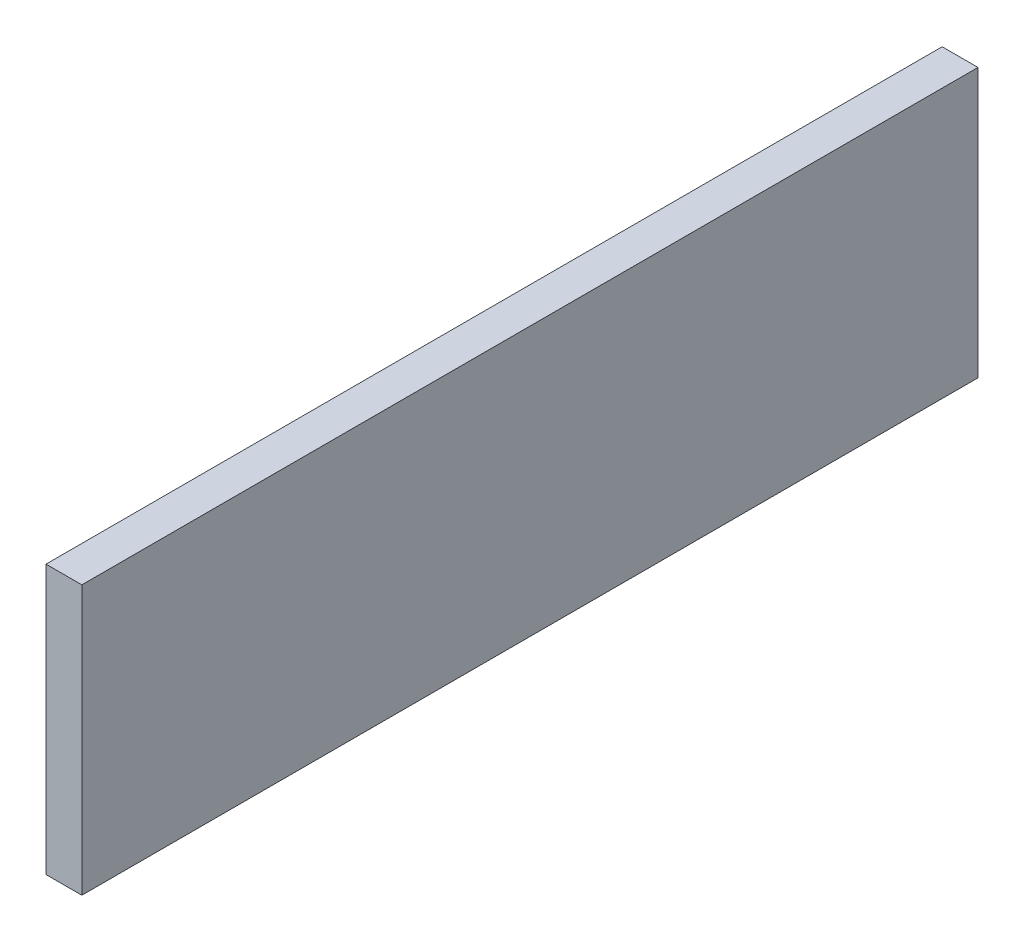
ISO-10303-21;
HEADER;
FILE_DESCRIPTION(('STEP AP214'),'2;1');
FILE_NAME('part.step','',(''),(''),'','','');
FILE_SCHEMA(('AUTOMOTIVE_DESIGN { 1 0 10303 214 1 1 1 1 }'));
ENDSEC;
DATA;
#1=APPLICATION_CONTEXT('core data for automotive mechanical design processes');
#2=APPLICATION_PROTOCOL_DEFINITION('international standard','automotive_design',2000,#1);
#3=PRODUCT_CONTEXT('',#1,'mechanical');
#4=PRODUCT('Part','Part','',(#3));
#5=PRODUCT_RELATED_PRODUCT_CATEGORY('part','',(#4));
#6=PRODUCT_DEFINITION_FORMATION('','',#4);
#7=PRODUCT_DEFINITION_CONTEXT('part definition',#1,'design');
#8=PRODUCT_DEFINITION('design','',#6,#7);
#9=PRODUCT_DEFINITION_SHAPE('','',#8);
#10=(LENGTH_UNIT() NAMED_UNIT(*) SI_UNIT(.MILLI.,.METRE.));
#11=(NAMED_UNIT(*) PLANE_ANGLE_UNIT() SI_UNIT($,.RADIAN.));
#12=(NAMED_UNIT(*) SI_UNIT($,.STERADIAN.) SOLID_ANGLE_UNIT());
#13=UNCERTAINTY_MEASURE_WITH_UNIT(LENGTH_MEASURE(1.E-05),#10,'distance_accuracy_value','');
#14=(GEOMETRIC_REPRESENTATION_CONTEXT(3) GLOBAL_UNCERTAINTY_ASSIGNED_CONTEXT((#13)) GLOBAL_UNIT_ASSIGNED_CONTEXT((#10,
#11,#12)) REPRESENTATION_CONTEXT('',''));
#15=CARTESIAN_POINT('',(0.,0.,0.));
#16=DIRECTION('',(0.,0.,1.));
#17=DIRECTION('',(1.,0.,0.));
#18=AXIS2_PLACEMENT_3D('',#15,#16,#17);
#19=CARTESIAN_POINT('',(2.54,0.,0.));
#20=DIRECTION('',(0.,0.,-1.));
#21=DIRECTION('',(0.,1.,0.));
#22=AXIS2_PLACEMENT_3D('',#19,#20,#21);
#23=PLANE('',#22);
#24=DIRECTION('',(0.,-1.,0.));
#25=VECTOR('',#24,1.);
#26=CARTESIAN_POINT('',(0.,0.,0.));
#27=LINE('',#26,#25);
#28=CARTESIAN_POINT('',(0.,0.,0.));
#29=VERTEX_POINT('',#28);
#30=CARTESIAN_POINT('',(0.,-19.05,0.));
#31=VERTEX_POINT('',#30);
#32=EDGE_CURVE('E107',#29,#31,#27,.T.);
#33=ORIENTED_EDGE('',*,*,#32,.T.);
#34=DIRECTION('',(-1.,0.,0.));
#35=VECTOR('',#34,1.);
#36=CARTESIAN_POINT('',(2.54,-19.05,0.));
#37=LINE('',#36,#35);
#38=CARTESIAN_POINT('',(2.54,-19.05,0.));
#39=VERTEX_POINT('',#38);
#40=EDGE_CURVE('E11',#39,#31,#37,.T.);
#41=ORIENTED_EDGE('',*,*,#40,.F.);
#42=DIRECTION('',(0.,-1.,0.));
#43=VECTOR('',#42,1.);
#44=CARTESIAN_POINT('',(2.54,0.,0.));
#45=LINE('',#44,#43);
#46=CARTESIAN_POINT('',(2.54,0.,0.));
#47=VERTEX_POINT('',#46);
#48=EDGE_CURVE('E91',#47,#39,#45,.T.);
#49=ORIENTED_EDGE('',*,*,#48,.F.);
#50=DIRECTION('',(-1.,0.,0.));
#51=VECTOR('',#50,1.);
#52=CARTESIAN_POINT('',(2.54,0.,0.));
#53=LINE('',#52,#51);
#54=EDGE_CURVE('E103',#47,#29,#53,.T.);
#55=ORIENTED_EDGE('',*,*,#54,.T.);
#56=EDGE_LOOP('',(#33,#41,#49,#55));
#57=FACE_BOUND('',#56,.T.);
#58=ADVANCED_FACE('F39',(#57),#23,.F.);
#59=CARTESIAN_POINT('',(2.54,-19.05,0.));
#60=DIRECTION('',(0.,1.,0.));
#61=DIRECTION('',(0.,0.,1.));
#62=AXIS2_PLACEMENT_3D('',#59,#60,#61);
#63=PLANE('',#62);
#64=DIRECTION('',(0.,0.,-1.));
#65=VECTOR('',#64,1.);
#66=CARTESIAN_POINT('',(0.,-19.05,0.));
#67=LINE('',#66,#65);
#68=CARTESIAN_POINT('',(0.,-19.05,-63.5));
#69=VERTEX_POINT('',#68);
#70=EDGE_CURVE('E96',#31,#69,#67,.T.);
#71=ORIENTED_EDGE('',*,*,#70,.T.);
#72=DIRECTION('',(-1.,0.,0.));
#73=VECTOR('',#72,1.);
#74=CARTESIAN_POINT('',(2.54,-19.05,-63.5));
#75=LINE('',#74,#73);
#76=CARTESIAN_POINT('',(2.54,-19.05,-63.5));
#77=VERTEX_POINT('',#76);
#78=EDGE_CURVE('E48',#77,#69,#75,.T.);
#79=ORIENTED_EDGE('',*,*,#78,.F.);
#80=DIRECTION('',(0.,0.,-1.));
#81=VECTOR('',#80,1.);
#82=CARTESIAN_POINT('',(2.54,-19.05,0.));
#83=LINE('',#82,#81);
#84=EDGE_CURVE('E86',#39,#77,#83,.T.);
#85=ORIENTED_EDGE('',*,*,#84,.F.);
#86=ORIENTED_EDGE('',*,*,#40,.T.);
#87=EDGE_LOOP('',(#71,#79,#85,#86));
#88=FACE_BOUND('',#87,.T.);
#89=ADVANCED_FACE('F95',(#88),#63,.F.);
#90=CARTESIAN_POINT('',(2.54,0.,-63.5));
#91=DIRECTION('',(0.,0.,1.));
#92=DIRECTION('',(1.,0.,0.));
#93=AXIS2_PLACEMENT_3D('',#90,#91,#92);
#94=PLANE('',#93);
#95=DIRECTION('',(0.,1.,0.));
#96=VECTOR('',#95,1.);
#97=CARTESIAN_POINT('',(0.,0.,-63.5));
#98=LINE('',#97,#96);
#99=CARTESIAN_POINT('',(0.,0.,-63.5));
#100=VERTEX_POINT('',#99);
#101=EDGE_CURVE('E73',#69,#100,#98,.T.);
#102=ORIENTED_EDGE('',*,*,#101,.T.);
#103=DIRECTION('',(-1.,0.,0.));
#104=VECTOR('',#103,1.);
#105=CARTESIAN_POINT('',(2.54,0.,-63.5));
#106=LINE('',#105,#104);
#107=CARTESIAN_POINT('',(2.54,0.,-63.5));
#108=VERTEX_POINT('',#107);
#109=EDGE_CURVE('E98',#108,#100,#106,.T.);
#110=ORIENTED_EDGE('',*,*,#109,.F.);
#111=DIRECTION('',(0.,1.,0.));
#112=VECTOR('',#111,1.);
#113=CARTESIAN_POINT('',(2.54,0.,-63.5));
#114=LINE('',#113,#112);
#115=EDGE_CURVE('E89',#77,#108,#114,.T.);
#116=ORIENTED_EDGE('',*,*,#115,.F.);
#117=ORIENTED_EDGE('',*,*,#78,.T.);
#118=EDGE_LOOP('',(#102,#110,#116,#117));
#119=FACE_BOUND('',#118,.T.);
#120=ADVANCED_FACE('F99',(#119),#94,.F.);
#121=CARTESIAN_POINT('',(2.54,0.,0.));
#122=DIRECTION('',(0.,-1.,0.));
#123=DIRECTION('',(0.,0.,-1.));
#124=AXIS2_PLACEMENT_3D('',#121,#122,#123);
#125=PLANE('',#124);
#126=DIRECTION('',(0.,0.,1.));
#127=VECTOR('',#126,1.);
#128=CARTESIAN_POINT('',(0.,0.,0.));
#129=LINE('',#128,#127);
#130=EDGE_CURVE('E79',#100,#29,#129,.T.);
#131=ORIENTED_EDGE('',*,*,#130,.T.);
#132=ORIENTED_EDGE('',*,*,#54,.F.);
#133=DIRECTION('',(0.,0.,1.));
#134=VECTOR('',#133,1.);
#135=CARTESIAN_POINT('',(2.54,0.,0.));
#136=LINE('',#135,#134);
#137=EDGE_CURVE('E56',#108,#47,#136,.T.);
#138=ORIENTED_EDGE('',*,*,#137,.F.);
#139=ORIENTED_EDGE('',*,*,#109,.T.);
#140=EDGE_LOOP('',(#131,#132,#138,#139));
#141=FACE_BOUND('',#140,.T.);
#142=ADVANCED_FACE('F120',(#141),#125,.F.);
#143=CARTESIAN_POINT('',(2.54,0.,0.));
#144=DIRECTION('',(1.,0.,0.));
#145=DIRECTION('',(0.,0.,-1.));
#146=AXIS2_PLACEMENT_3D('',#143,#144,#145);
#147=PLANE('',#146);
#148=ORIENTED_EDGE('',*,*,#48,.T.);
#149=ORIENTED_EDGE('',*,*,#84,.T.);
#150=ORIENTED_EDGE('',*,*,#115,.T.);
#151=ORIENTED_EDGE('',*,*,#137,.T.);
#152=EDGE_LOOP('',(#148,#149,#150,#151));
#153=FACE_BOUND('',#152,.T.);
#154=ADVANCED_FACE('F87',(#153),#147,.T.);
#155=CARTESIAN_POINT('',(0.,0.,0.));
#156=DIRECTION('',(1.,0.,0.));
#157=DIRECTION('',(0.,0.,-1.));
#158=AXIS2_PLACEMENT_3D('',#155,#156,#157);
#159=PLANE('',#158);
#160=ORIENTED_EDGE('',*,*,#32,.F.);
#161=ORIENTED_EDGE('',*,*,#130,.F.);
#162=ORIENTED_EDGE('',*,*,#101,.F.);
#163=ORIENTED_EDGE('',*,*,#70,.F.);
#164=EDGE_LOOP('',(#160,#161,#162,#163));
#165=FACE_BOUND('',#164,.T.);
#166=ADVANCED_FACE('F123',(#165),#159,.F.);
#167=CLOSED_SHELL('',(#58,#89,#120,#142,#154,#166));
#168=MANIFOLD_SOLID_BREP('B2',#167);
#169=ADVANCED_BREP_SHAPE_REPRESENTATION('',(#18,#168),#14);
#170=SHAPE_DEFINITION_REPRESENTATION(#9,#169);
ENDSEC;
END-ISO-10303-21;
